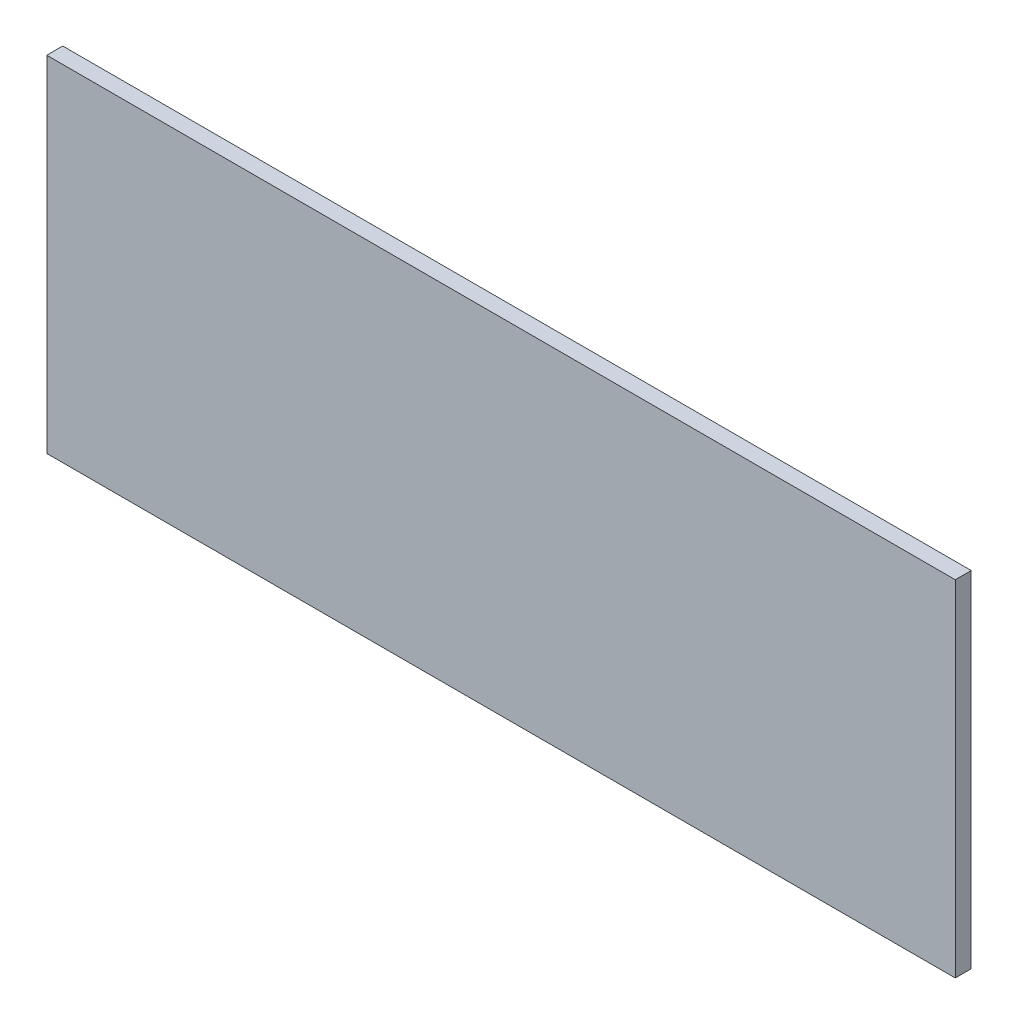
ISO-10303-21;
HEADER;
FILE_DESCRIPTION(('STEP AP214'),'2;1');
FILE_NAME('part.step','',(''),(''),'','','');
FILE_SCHEMA(('AUTOMOTIVE_DESIGN { 1 0 10303 214 1 1 1 1 }'));
ENDSEC;
DATA;
#1=APPLICATION_CONTEXT('core data for automotive mechanical design processes');
#2=APPLICATION_PROTOCOL_DEFINITION('international standard','automotive_design',2000,#1);
#3=PRODUCT_CONTEXT('',#1,'mechanical');
#4=PRODUCT('Part','Part','',(#3));
#5=PRODUCT_RELATED_PRODUCT_CATEGORY('part','',(#4));
#6=PRODUCT_DEFINITION_FORMATION('','',#4);
#7=PRODUCT_DEFINITION_CONTEXT('part definition',#1,'design');
#8=PRODUCT_DEFINITION('design','',#6,#7);
#9=PRODUCT_DEFINITION_SHAPE('','',#8);
#10=(LENGTH_UNIT() NAMED_UNIT(*) SI_UNIT(.MILLI.,.METRE.));
#11=(NAMED_UNIT(*) PLANE_ANGLE_UNIT() SI_UNIT($,.RADIAN.));
#12=(NAMED_UNIT(*) SI_UNIT($,.STERADIAN.) SOLID_ANGLE_UNIT());
#13=UNCERTAINTY_MEASURE_WITH_UNIT(LENGTH_MEASURE(1.E-05),#10,'distance_accuracy_value','');
#14=(GEOMETRIC_REPRESENTATION_CONTEXT(3) GLOBAL_UNCERTAINTY_ASSIGNED_CONTEXT((#13)) GLOBAL_UNIT_ASSIGNED_CONTEXT((#10,
#11,#12)) REPRESENTATION_CONTEXT('',''));
#15=CARTESIAN_POINT('',(0.,0.,0.));
#16=DIRECTION('',(0.,0.,1.));
#17=DIRECTION('',(1.,0.,0.));
#18=AXIS2_PLACEMENT_3D('',#15,#16,#17);
#19=CARTESIAN_POINT('',(-49.9406669150649,51.4574311364021,-1.89738));
#20=DIRECTION('',(-1.,0.,0.));
#21=DIRECTION('',(0.,-1.,0.));
#22=AXIS2_PLACEMENT_3D('',#19,#20,#21);
#23=PLANE('',#22);
#24=DIRECTION('',(0.,-1.,0.));
#25=VECTOR('',#24,1.);
#26=CARTESIAN_POINT('',(-49.9406669150649,51.4574311364021,0.));
#27=LINE('',#26,#25);
#28=CARTESIAN_POINT('',(-49.9406669150649,51.4574311364021,0.));
#29=VERTEX_POINT('',#28);
#30=CARTESIAN_POINT('',(-49.9406669150649,10.4574311364021,0.));
#31=VERTEX_POINT('',#30);
#32=EDGE_CURVE('E99',#29,#31,#27,.T.);
#33=ORIENTED_EDGE('',*,*,#32,.F.);
#34=DIRECTION('',(0.,0.,1.));
#35=VECTOR('',#34,1.);
#36=CARTESIAN_POINT('',(-49.9406669150649,51.4574311364021,-1.89738));
#37=LINE('',#36,#35);
#38=CARTESIAN_POINT('',(-49.9406669150649,51.4574311364021,-1.89738));
#39=VERTEX_POINT('',#38);
#40=EDGE_CURVE('E11',#39,#29,#37,.T.);
#41=ORIENTED_EDGE('',*,*,#40,.F.);
#42=DIRECTION('',(0.,-1.,0.));
#43=VECTOR('',#42,1.);
#44=CARTESIAN_POINT('',(-49.9406669150649,51.4574311364021,-1.89738));
#45=LINE('',#44,#43);
#46=CARTESIAN_POINT('',(-49.9406669150649,10.4574311364021,-1.89738));
#47=VERTEX_POINT('',#46);
#48=EDGE_CURVE('E93',#39,#47,#45,.T.);
#49=ORIENTED_EDGE('',*,*,#48,.T.);
#50=DIRECTION('',(0.,0.,1.));
#51=VECTOR('',#50,1.);
#52=CARTESIAN_POINT('',(-49.9406669150649,10.4574311364021,-1.89738));
#53=LINE('',#52,#51);
#54=EDGE_CURVE('E38',#47,#31,#53,.T.);
#55=ORIENTED_EDGE('',*,*,#54,.T.);
#56=EDGE_LOOP('',(#33,#41,#49,#55));
#57=FACE_BOUND('',#56,.T.);
#58=ADVANCED_FACE('F35',(#57),#23,.T.);
#59=CARTESIAN_POINT('',(-49.9406669150649,51.4574311364021,-1.89738));
#60=DIRECTION('',(0.,1.,0.));
#61=DIRECTION('',(0.,0.,1.));
#62=AXIS2_PLACEMENT_3D('',#59,#60,#61);
#63=PLANE('',#62);
#64=DIRECTION('',(-1.,0.,0.));
#65=VECTOR('',#64,1.);
#66=CARTESIAN_POINT('',(-49.9406669150649,51.4574311364021,0.));
#67=LINE('',#66,#65);
#68=CARTESIAN_POINT('',(58.0593330849351,51.4574311364021,0.));
#69=VERTEX_POINT('',#68);
#70=EDGE_CURVE('E95',#69,#29,#67,.T.);
#71=ORIENTED_EDGE('',*,*,#70,.F.);
#72=DIRECTION('',(0.,0.,1.));
#73=VECTOR('',#72,1.);
#74=CARTESIAN_POINT('',(58.0593330849351,51.4574311364021,-1.89738));
#75=LINE('',#74,#73);
#76=CARTESIAN_POINT('',(58.0593330849351,51.4574311364021,-1.89738));
#77=VERTEX_POINT('',#76);
#78=EDGE_CURVE('E44',#77,#69,#75,.T.);
#79=ORIENTED_EDGE('',*,*,#78,.F.);
#80=DIRECTION('',(-1.,0.,0.));
#81=VECTOR('',#80,1.);
#82=CARTESIAN_POINT('',(-49.9406669150649,51.4574311364021,-1.89738));
#83=LINE('',#82,#81);
#84=EDGE_CURVE('E90',#77,#39,#83,.T.);
#85=ORIENTED_EDGE('',*,*,#84,.T.);
#86=ORIENTED_EDGE('',*,*,#40,.T.);
#87=EDGE_LOOP('',(#71,#79,#85,#86));
#88=FACE_BOUND('',#87,.T.);
#89=ADVANCED_FACE('F109',(#88),#63,.T.);
#90=CARTESIAN_POINT('',(58.0593330849351,51.4574311364021,-1.89738));
#91=DIRECTION('',(1.,0.,0.));
#92=DIRECTION('',(0.,1.,0.));
#93=AXIS2_PLACEMENT_3D('',#90,#91,#92);
#94=PLANE('',#93);
#95=DIRECTION('',(0.,1.,0.));
#96=VECTOR('',#95,1.);
#97=CARTESIAN_POINT('',(58.0593330849351,51.4574311364021,0.));
#98=LINE('',#97,#96);
#99=CARTESIAN_POINT('',(58.0593330849351,10.4574311364021,0.));
#100=VERTEX_POINT('',#99);
#101=EDGE_CURVE('E85',#100,#69,#98,.T.);
#102=ORIENTED_EDGE('',*,*,#101,.F.);
#103=DIRECTION('',(0.,0.,1.));
#104=VECTOR('',#103,1.);
#105=CARTESIAN_POINT('',(58.0593330849351,10.4574311364021,-1.89738));
#106=LINE('',#105,#104);
#107=CARTESIAN_POINT('',(58.0593330849351,10.4574311364021,-1.89738));
#108=VERTEX_POINT('',#107);
#109=EDGE_CURVE('E80',#108,#100,#106,.T.);
#110=ORIENTED_EDGE('',*,*,#109,.F.);
#111=DIRECTION('',(0.,1.,0.));
#112=VECTOR('',#111,1.);
#113=CARTESIAN_POINT('',(58.0593330849351,51.4574311364021,-1.89738));
#114=LINE('',#113,#112);
#115=EDGE_CURVE('E83',#108,#77,#114,.T.);
#116=ORIENTED_EDGE('',*,*,#115,.T.);
#117=ORIENTED_EDGE('',*,*,#78,.T.);
#118=EDGE_LOOP('',(#102,#110,#116,#117));
#119=FACE_BOUND('',#118,.T.);
#120=ADVANCED_FACE('F82',(#119),#94,.T.);
#121=CARTESIAN_POINT('',(-49.9406669150649,10.4574311364021,-1.89738));
#122=DIRECTION('',(0.,-1.,0.));
#123=DIRECTION('',(0.,0.,-1.));
#124=AXIS2_PLACEMENT_3D('',#121,#122,#123);
#125=PLANE('',#124);
#126=DIRECTION('',(1.,0.,0.));
#127=VECTOR('',#126,1.);
#128=CARTESIAN_POINT('',(-49.9406669150649,10.4574311364021,0.));
#129=LINE('',#128,#127);
#130=EDGE_CURVE('E102',#31,#100,#129,.T.);
#131=ORIENTED_EDGE('',*,*,#130,.F.);
#132=ORIENTED_EDGE('',*,*,#54,.F.);
#133=DIRECTION('',(1.,0.,0.));
#134=VECTOR('',#133,1.);
#135=CARTESIAN_POINT('',(-49.9406669150649,10.4574311364021,-1.89738));
#136=LINE('',#135,#134);
#137=EDGE_CURVE('E89',#47,#108,#136,.T.);
#138=ORIENTED_EDGE('',*,*,#137,.T.);
#139=ORIENTED_EDGE('',*,*,#109,.T.);
#140=EDGE_LOOP('',(#131,#132,#138,#139));
#141=FACE_BOUND('',#140,.T.);
#142=ADVANCED_FACE('F92',(#141),#125,.T.);
#143=CARTESIAN_POINT('',(0.,0.,-1.89738));
#144=DIRECTION('',(0.,0.,1.));
#145=DIRECTION('',(1.,0.,0.));
#146=AXIS2_PLACEMENT_3D('',#143,#144,#145);
#147=PLANE('',#146);
#148=ORIENTED_EDGE('',*,*,#48,.F.);
#149=ORIENTED_EDGE('',*,*,#84,.F.);
#150=ORIENTED_EDGE('',*,*,#115,.F.);
#151=ORIENTED_EDGE('',*,*,#137,.F.);
#152=EDGE_LOOP('',(#148,#149,#150,#151));
#153=FACE_BOUND('',#152,.T.);
#154=ADVANCED_FACE('F88',(#153),#147,.F.);
#155=CARTESIAN_POINT('',(0.,0.,0.));
#156=DIRECTION('',(0.,0.,1.));
#157=DIRECTION('',(1.,0.,0.));
#158=AXIS2_PLACEMENT_3D('',#155,#156,#157);
#159=PLANE('',#158);
#160=ORIENTED_EDGE('',*,*,#32,.T.);
#161=ORIENTED_EDGE('',*,*,#130,.T.);
#162=ORIENTED_EDGE('',*,*,#101,.T.);
#163=ORIENTED_EDGE('',*,*,#70,.T.);
#164=EDGE_LOOP('',(#160,#161,#162,#163));
#165=FACE_BOUND('',#164,.T.);
#166=ADVANCED_FACE('F108',(#165),#159,.T.);
#167=CLOSED_SHELL('',(#58,#89,#120,#142,#154,#166));
#168=MANIFOLD_SOLID_BREP('B2',#167);
#169=ADVANCED_BREP_SHAPE_REPRESENTATION('',(#18,#168),#14);
#170=SHAPE_DEFINITION_REPRESENTATION(#9,#169);
ENDSEC;
END-ISO-10303-21;
